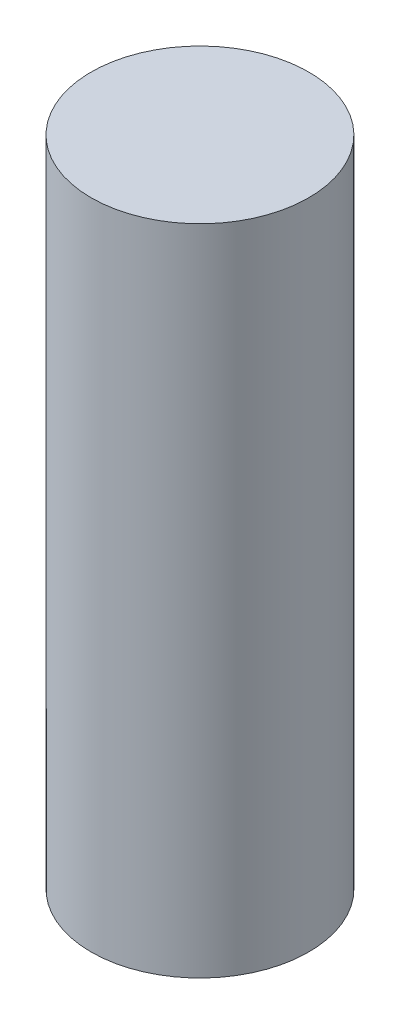
ISO-10303-21;
HEADER;
FILE_DESCRIPTION(('STEP AP214'),'2;1');
FILE_NAME('part.step','',(''),(''),'','','');
FILE_SCHEMA(('AUTOMOTIVE_DESIGN { 1 0 10303 214 1 1 1 1 }'));
ENDSEC;
DATA;
#1=APPLICATION_CONTEXT('core data for automotive mechanical design processes');
#2=APPLICATION_PROTOCOL_DEFINITION('international standard','automotive_design',2000,#1);
#3=PRODUCT_CONTEXT('',#1,'mechanical');
#4=PRODUCT('Part','Part','',(#3));
#5=PRODUCT_RELATED_PRODUCT_CATEGORY('part','',(#4));
#6=PRODUCT_DEFINITION_FORMATION('','',#4);
#7=PRODUCT_DEFINITION_CONTEXT('part definition',#1,'design');
#8=PRODUCT_DEFINITION('design','',#6,#7);
#9=PRODUCT_DEFINITION_SHAPE('','',#8);
#10=(LENGTH_UNIT() NAMED_UNIT(*) SI_UNIT(.MILLI.,.METRE.));
#11=(NAMED_UNIT(*) PLANE_ANGLE_UNIT() SI_UNIT($,.RADIAN.));
#12=(NAMED_UNIT(*) SI_UNIT($,.STERADIAN.) SOLID_ANGLE_UNIT());
#13=UNCERTAINTY_MEASURE_WITH_UNIT(LENGTH_MEASURE(1.E-05),#10,'distance_accuracy_value','');
#14=(GEOMETRIC_REPRESENTATION_CONTEXT(3) GLOBAL_UNCERTAINTY_ASSIGNED_CONTEXT((#13)) GLOBAL_UNIT_ASSIGNED_CONTEXT((#10,
#11,#12)) REPRESENTATION_CONTEXT('',''));
#15=CARTESIAN_POINT('',(0.,0.,0.));
#16=DIRECTION('',(0.,0.,1.));
#17=DIRECTION('',(1.,0.,0.));
#18=AXIS2_PLACEMENT_3D('',#15,#16,#17);
#19=CARTESIAN_POINT('',(0.,6.,0.));
#20=DIRECTION('',(0.,-1.,0.));
#21=DIRECTION('',(0.,0.,-1.));
#22=AXIS2_PLACEMENT_3D('',#19,#20,#21);
#23=CYLINDRICAL_SURFACE('',#22,1.);
#24=CARTESIAN_POINT('',(0.,6.,0.));
#25=DIRECTION('',(0.,1.,0.));
#26=DIRECTION('',(0.,0.,1.));
#27=AXIS2_PLACEMENT_3D('',#24,#25,#26);
#28=CIRCLE('',#27,1.);
#29=CARTESIAN_POINT('',(0.,6.,1.));
#30=VERTEX_POINT('',#29);
#31=EDGE_CURVE('E10',#30,#30,#28,.T.);
#32=ORIENTED_EDGE('',*,*,#31,.F.);
#33=EDGE_LOOP('',(#32));
#34=FACE_BOUND('',#33,.T.);
#35=CARTESIAN_POINT('',(0.,0.,0.));
#36=DIRECTION('',(0.,1.,0.));
#37=DIRECTION('',(0.,0.,1.));
#38=AXIS2_PLACEMENT_3D('',#35,#36,#37);
#39=CIRCLE('',#38,1.);
#40=CARTESIAN_POINT('',(0.,0.,1.));
#41=VERTEX_POINT('',#40);
#42=EDGE_CURVE('E40',#41,#41,#39,.T.);
#43=ORIENTED_EDGE('',*,*,#42,.T.);
#44=EDGE_LOOP('',(#43));
#45=FACE_BOUND('',#44,.T.);
#46=ADVANCED_FACE('F37',(#34,#45),#23,.T.);
#47=CARTESIAN_POINT('',(0.,6.,0.));
#48=DIRECTION('',(0.,1.,0.));
#49=DIRECTION('',(0.,0.,1.));
#50=AXIS2_PLACEMENT_3D('',#47,#48,#49);
#51=PLANE('',#50);
#52=ORIENTED_EDGE('',*,*,#31,.T.);
#53=EDGE_LOOP('',(#52));
#54=FACE_BOUND('',#53,.T.);
#55=ADVANCED_FACE('F54',(#54),#51,.T.);
#56=CARTESIAN_POINT('',(0.,0.,0.));
#57=DIRECTION('',(0.,1.,0.));
#58=DIRECTION('',(0.,0.,1.));
#59=AXIS2_PLACEMENT_3D('',#56,#57,#58);
#60=PLANE('',#59);
#61=ORIENTED_EDGE('',*,*,#42,.F.);
#62=EDGE_LOOP('',(#61));
#63=FACE_BOUND('',#62,.T.);
#64=ADVANCED_FACE('F52',(#63),#60,.F.);
#65=CLOSED_SHELL('',(#46,#55,#64));
#66=MANIFOLD_SOLID_BREP('B2',#65);
#67=ADVANCED_BREP_SHAPE_REPRESENTATION('',(#18,#66),#14);
#68=SHAPE_DEFINITION_REPRESENTATION(#9,#67);
ENDSEC;
END-ISO-10303-21;
